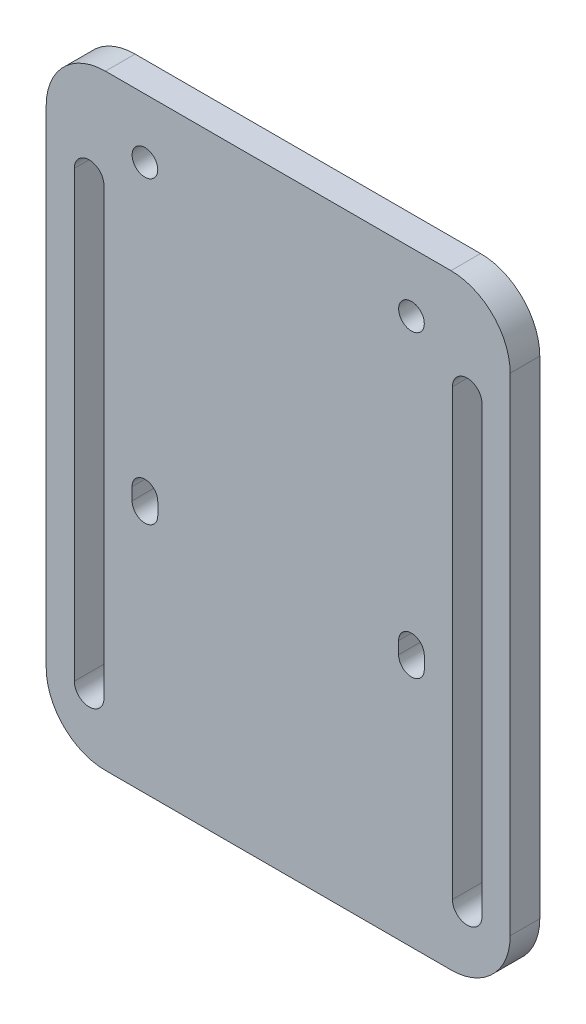
ISO-10303-21;
HEADER;
FILE_DESCRIPTION(('STEP AP214'),'2;1');
FILE_NAME('part.step','',(''),(''),'','','');
FILE_SCHEMA(('AUTOMOTIVE_DESIGN { 1 0 10303 214 1 1 1 1 }'));
ENDSEC;
DATA;
#1=APPLICATION_CONTEXT('core data for automotive mechanical design processes');
#2=APPLICATION_PROTOCOL_DEFINITION('international standard','automotive_design',2000,#1);
#3=PRODUCT_CONTEXT('',#1,'mechanical');
#4=PRODUCT('Part','Part','',(#3));
#5=PRODUCT_RELATED_PRODUCT_CATEGORY('part','',(#4));
#6=PRODUCT_DEFINITION_FORMATION('','',#4);
#7=PRODUCT_DEFINITION_CONTEXT('part definition',#1,'design');
#8=PRODUCT_DEFINITION('design','',#6,#7);
#9=PRODUCT_DEFINITION_SHAPE('','',#8);
#10=(LENGTH_UNIT() NAMED_UNIT(*) SI_UNIT(.MILLI.,.METRE.));
#11=(NAMED_UNIT(*) PLANE_ANGLE_UNIT() SI_UNIT($,.RADIAN.));
#12=(NAMED_UNIT(*) SI_UNIT($,.STERADIAN.) SOLID_ANGLE_UNIT());
#13=UNCERTAINTY_MEASURE_WITH_UNIT(LENGTH_MEASURE(1.E-05),#10,'distance_accuracy_value','');
#14=(GEOMETRIC_REPRESENTATION_CONTEXT(3) GLOBAL_UNCERTAINTY_ASSIGNED_CONTEXT((#13)) GLOBAL_UNIT_ASSIGNED_CONTEXT((#10,
#11,#12)) REPRESENTATION_CONTEXT('',''));
#15=CARTESIAN_POINT('',(0.,0.,0.));
#16=DIRECTION('',(0.,0.,1.));
#17=DIRECTION('',(1.,0.,0.));
#18=AXIS2_PLACEMENT_3D('',#15,#16,#17);
#19=CARTESIAN_POINT('',(-35.3,0.,6.));
#20=DIRECTION('',(1.,0.,0.));
#21=DIRECTION('',(0.,0.,-1.));
#22=AXIS2_PLACEMENT_3D('',#19,#20,#21);
#23=PLANE('',#22);
#24=DIRECTION('',(0.,-1.,0.));
#25=VECTOR('',#24,1.);
#26=CARTESIAN_POINT('',(-35.3,0.,0.));
#27=LINE('',#26,#25);
#28=CARTESIAN_POINT('',(-35.3,102.5,0.));
#29=VERTEX_POINT('',#28);
#30=CARTESIAN_POINT('',(-35.3,12.5,0.));
#31=VERTEX_POINT('',#30);
#32=EDGE_CURVE('E289',#29,#31,#27,.T.);
#33=ORIENTED_EDGE('',*,*,#32,.T.);
#34=DIRECTION('',(0.,0.,-1.));
#35=VECTOR('',#34,1.);
#36=CARTESIAN_POINT('',(-35.3,12.5,6.));
#37=LINE('',#36,#35);
#38=CARTESIAN_POINT('',(-35.3,12.5,6.));
#39=VERTEX_POINT('',#38);
#40=EDGE_CURVE('E11',#39,#31,#37,.T.);
#41=ORIENTED_EDGE('',*,*,#40,.F.);
#42=DIRECTION('',(0.,-1.,0.));
#43=VECTOR('',#42,1.);
#44=CARTESIAN_POINT('',(-35.3,0.,6.));
#45=LINE('',#44,#43);
#46=CARTESIAN_POINT('',(-35.3,102.5,6.));
#47=VERTEX_POINT('',#46);
#48=EDGE_CURVE('E209',#47,#39,#45,.T.);
#49=ORIENTED_EDGE('',*,*,#48,.F.);
#50=DIRECTION('',(0.,0.,-1.));
#51=VECTOR('',#50,1.);
#52=CARTESIAN_POINT('',(-35.3,102.5,6.));
#53=LINE('',#52,#51);
#54=EDGE_CURVE('E53',#47,#29,#53,.T.);
#55=ORIENTED_EDGE('',*,*,#54,.T.);
#56=EDGE_LOOP('',(#33,#41,#49,#55));
#57=FACE_BOUND('',#56,.T.);
#58=ADVANCED_FACE('F34',(#57),#23,.F.);
#59=CARTESIAN_POINT('',(-38.3,12.5,6.));
#60=DIRECTION('',(0.,0.,-1.));
#61=DIRECTION('',(-1.,0.,0.));
#62=AXIS2_PLACEMENT_3D('',#59,#60,#61);
#63=CYLINDRICAL_SURFACE('',#62,3.00000000000002);
#64=CARTESIAN_POINT('',(-38.3,12.5,0.));
#65=DIRECTION('',(0.,0.,1.));
#66=DIRECTION('',(1.,0.,0.));
#67=AXIS2_PLACEMENT_3D('',#64,#65,#66);
#68=CIRCLE('',#67,3.00000000000002);
#69=CARTESIAN_POINT('',(-41.3,12.5,0.));
#70=VERTEX_POINT('',#69);
#71=EDGE_CURVE('E215',#31,#70,#68,.F.);
#72=ORIENTED_EDGE('',*,*,#71,.T.);
#73=DIRECTION('',(0.,0.,-1.));
#74=VECTOR('',#73,1.);
#75=CARTESIAN_POINT('',(-41.3,12.5,6.));
#76=LINE('',#75,#74);
#77=CARTESIAN_POINT('',(-41.3,12.5,6.));
#78=VERTEX_POINT('',#77);
#79=EDGE_CURVE('E44',#78,#70,#76,.T.);
#80=ORIENTED_EDGE('',*,*,#79,.F.);
#81=CARTESIAN_POINT('',(-38.3,12.5,6.));
#82=DIRECTION('',(0.,0.,1.));
#83=DIRECTION('',(1.,0.,0.));
#84=AXIS2_PLACEMENT_3D('',#81,#82,#83);
#85=CIRCLE('',#84,3.00000000000002);
#86=EDGE_CURVE('E203',#39,#78,#85,.F.);
#87=ORIENTED_EDGE('',*,*,#86,.F.);
#88=ORIENTED_EDGE('',*,*,#40,.T.);
#89=EDGE_LOOP('',(#72,#80,#87,#88));
#90=FACE_BOUND('',#89,.T.);
#91=ADVANCED_FACE('F214',(#90),#63,.F.);
#92=CARTESIAN_POINT('',(-41.3,0.,6.));
#93=DIRECTION('',(-1.,0.,0.));
#94=DIRECTION('',(0.,-1.,0.));
#95=AXIS2_PLACEMENT_3D('',#92,#93,#94);
#96=PLANE('',#95);
#97=DIRECTION('',(0.,1.,0.));
#98=VECTOR('',#97,1.);
#99=CARTESIAN_POINT('',(-41.3,0.,0.));
#100=LINE('',#99,#98);
#101=CARTESIAN_POINT('',(-41.3,102.5,0.));
#102=VERTEX_POINT('',#101);
#103=EDGE_CURVE('E292',#70,#102,#100,.T.);
#104=ORIENTED_EDGE('',*,*,#103,.T.);
#105=DIRECTION('',(0.,0.,-1.));
#106=VECTOR('',#105,1.);
#107=CARTESIAN_POINT('',(-41.3,102.5,6.));
#108=LINE('',#107,#106);
#109=CARTESIAN_POINT('',(-41.3,102.5,6.));
#110=VERTEX_POINT('',#109);
#111=EDGE_CURVE('E128',#110,#102,#108,.T.);
#112=ORIENTED_EDGE('',*,*,#111,.F.);
#113=DIRECTION('',(0.,1.,0.));
#114=VECTOR('',#113,1.);
#115=CARTESIAN_POINT('',(-41.3,0.,6.));
#116=LINE('',#115,#114);
#117=EDGE_CURVE('E208',#78,#110,#116,.T.);
#118=ORIENTED_EDGE('',*,*,#117,.F.);
#119=ORIENTED_EDGE('',*,*,#79,.T.);
#120=EDGE_LOOP('',(#104,#112,#118,#119));
#121=FACE_BOUND('',#120,.T.);
#122=ADVANCED_FACE('F219',(#121),#96,.F.);
#123=CARTESIAN_POINT('',(27.,50.,6.));
#124=DIRECTION('',(0.,0.,-1.));
#125=DIRECTION('',(-1.,0.,0.));
#126=AXIS2_PLACEMENT_3D('',#123,#124,#125);
#127=CYLINDRICAL_SURFACE('',#126,2.6000000000001);
#128=CARTESIAN_POINT('',(27.,50.,0.));
#129=DIRECTION('',(0.,0.,1.));
#130=DIRECTION('',(1.,0.,0.));
#131=AXIS2_PLACEMENT_3D('',#128,#129,#130);
#132=CIRCLE('',#131,2.6000000000001);
#133=CARTESIAN_POINT('',(24.3999999999999,50.,0.));
#134=VERTEX_POINT('',#133);
#135=CARTESIAN_POINT('',(29.6000000000001,50.,0.));
#136=VERTEX_POINT('',#135);
#137=EDGE_CURVE('E274',#134,#136,#132,.T.);
#138=ORIENTED_EDGE('',*,*,#137,.F.);
#139=DIRECTION('',(0.,0.,-1.));
#140=VECTOR('',#139,1.);
#141=CARTESIAN_POINT('',(24.3999999999999,50.,6.));
#142=LINE('',#141,#140);
#143=CARTESIAN_POINT('',(24.3999999999999,50.,6.));
#144=VERTEX_POINT('',#143);
#145=EDGE_CURVE('E299',#144,#134,#142,.T.);
#146=ORIENTED_EDGE('',*,*,#145,.F.);
#147=CARTESIAN_POINT('',(27.,50.,6.));
#148=DIRECTION('',(0.,0.,1.));
#149=DIRECTION('',(1.,0.,0.));
#150=AXIS2_PLACEMENT_3D('',#147,#148,#149);
#151=CIRCLE('',#150,2.6000000000001);
#152=CARTESIAN_POINT('',(29.6000000000001,50.,6.));
#153=VERTEX_POINT('',#152);
#154=EDGE_CURVE('E402',#144,#153,#151,.T.);
#155=ORIENTED_EDGE('',*,*,#154,.T.);
#156=DIRECTION('',(0.,0.,-1.));
#157=VECTOR('',#156,1.);
#158=CARTESIAN_POINT('',(29.6000000000001,50.,6.));
#159=LINE('',#158,#157);
#160=EDGE_CURVE('E301',#153,#136,#159,.T.);
#161=ORIENTED_EDGE('',*,*,#160,.T.);
#162=EDGE_LOOP('',(#138,#146,#155,#161));
#163=FACE_BOUND('',#162,.T.);
#164=ADVANCED_FACE('F458',(#163),#127,.F.);
#165=CARTESIAN_POINT('',(24.3999999999999,0.,6.));
#166=DIRECTION('',(-1.,0.,0.));
#167=DIRECTION('',(0.,0.,1.));
#168=AXIS2_PLACEMENT_3D('',#165,#166,#167);
#169=PLANE('',#168);
#170=DIRECTION('',(0.,1.,0.));
#171=VECTOR('',#170,1.);
#172=CARTESIAN_POINT('',(24.3999999999999,0.,0.));
#173=LINE('',#172,#171);
#174=CARTESIAN_POINT('',(24.3999999999999,52.5000000000005,0.));
#175=VERTEX_POINT('',#174);
#176=EDGE_CURVE('E277',#134,#175,#173,.T.);
#177=ORIENTED_EDGE('',*,*,#176,.T.);
#178=DIRECTION('',(0.,0.,-1.));
#179=VECTOR('',#178,1.);
#180=CARTESIAN_POINT('',(24.3999999999999,52.5000000000005,6.));
#181=LINE('',#180,#179);
#182=CARTESIAN_POINT('',(24.3999999999999,52.5000000000005,6.));
#183=VERTEX_POINT('',#182);
#184=EDGE_CURVE('E307',#183,#175,#181,.T.);
#185=ORIENTED_EDGE('',*,*,#184,.F.);
#186=DIRECTION('',(0.,1.,0.));
#187=VECTOR('',#186,1.);
#188=CARTESIAN_POINT('',(24.3999999999999,0.,6.));
#189=LINE('',#188,#187);
#190=EDGE_CURVE('E405',#144,#183,#189,.T.);
#191=ORIENTED_EDGE('',*,*,#190,.F.);
#192=ORIENTED_EDGE('',*,*,#145,.T.);
#193=EDGE_LOOP('',(#177,#185,#191,#192));
#194=FACE_BOUND('',#193,.T.);
#195=ADVANCED_FACE('F454',(#194),#169,.F.);
#196=CARTESIAN_POINT('',(27.,52.5000000000005,6.));
#197=DIRECTION('',(0.,0.,-1.));
#198=DIRECTION('',(-1.,0.,0.));
#199=AXIS2_PLACEMENT_3D('',#196,#197,#198);
#200=CYLINDRICAL_SURFACE('',#199,2.6000000000001);
#201=CARTESIAN_POINT('',(27.,52.5000000000005,0.));
#202=DIRECTION('',(0.,0.,1.));
#203=DIRECTION('',(1.,0.,0.));
#204=AXIS2_PLACEMENT_3D('',#201,#202,#203);
#205=CIRCLE('',#204,2.6000000000001);
#206=CARTESIAN_POINT('',(29.6000000000001,52.5000000000005,0.));
#207=VERTEX_POINT('',#206);
#208=EDGE_CURVE('E280',#175,#207,#205,.F.);
#209=ORIENTED_EDGE('',*,*,#208,.T.);
#210=DIRECTION('',(0.,0.,-1.));
#211=VECTOR('',#210,1.);
#212=CARTESIAN_POINT('',(29.6000000000001,52.5000000000005,6.));
#213=LINE('',#212,#211);
#214=CARTESIAN_POINT('',(29.6000000000001,52.5000000000005,6.));
#215=VERTEX_POINT('',#214);
#216=EDGE_CURVE('E303',#215,#207,#213,.T.);
#217=ORIENTED_EDGE('',*,*,#216,.F.);
#218=CARTESIAN_POINT('',(27.,52.5000000000005,6.));
#219=DIRECTION('',(0.,0.,1.));
#220=DIRECTION('',(1.,0.,0.));
#221=AXIS2_PLACEMENT_3D('',#218,#219,#220);
#222=CIRCLE('',#221,2.6000000000001);
#223=EDGE_CURVE('E408',#183,#215,#222,.F.);
#224=ORIENTED_EDGE('',*,*,#223,.F.);
#225=ORIENTED_EDGE('',*,*,#184,.T.);
#226=EDGE_LOOP('',(#209,#217,#224,#225));
#227=FACE_BOUND('',#226,.T.);
#228=ADVANCED_FACE('F450',(#227),#200,.F.);
#229=CARTESIAN_POINT('',(-35.,110.7,6.));
#230=DIRECTION('',(0.,0.,-1.));
#231=DIRECTION('',(-1.,0.,0.));
#232=AXIS2_PLACEMENT_3D('',#229,#230,#231);
#233=CYLINDRICAL_SURFACE('',#232,12.);
#234=CARTESIAN_POINT('',(-35.,110.7,0.));
#235=DIRECTION('',(0.,0.,1.));
#236=DIRECTION('',(1.,0.,0.));
#237=AXIS2_PLACEMENT_3D('',#234,#235,#236);
#238=CIRCLE('',#237,12.);
#239=CARTESIAN_POINT('',(-47.,110.7,0.));
#240=VERTEX_POINT('',#239);
#241=CARTESIAN_POINT('',(-35.,122.7,0.));
#242=VERTEX_POINT('',#241);
#243=EDGE_CURVE('E247',#240,#242,#238,.F.);
#244=ORIENTED_EDGE('',*,*,#243,.F.);
#245=DIRECTION('',(0.,0.,-1.));
#246=VECTOR('',#245,1.);
#247=CARTESIAN_POINT('',(-47.,110.7,6.));
#248=LINE('',#247,#246);
#249=CARTESIAN_POINT('',(-47.,110.7,6.));
#250=VERTEX_POINT('',#249);
#251=EDGE_CURVE('E304',#250,#240,#248,.T.);
#252=ORIENTED_EDGE('',*,*,#251,.F.);
#253=CARTESIAN_POINT('',(-35.,110.7,6.));
#254=DIRECTION('',(0.,0.,1.));
#255=DIRECTION('',(1.,0.,0.));
#256=AXIS2_PLACEMENT_3D('',#253,#254,#255);
#257=CIRCLE('',#256,12.);
#258=CARTESIAN_POINT('',(-35.,122.7,6.));
#259=VERTEX_POINT('',#258);
#260=EDGE_CURVE('E378',#250,#259,#257,.F.);
#261=ORIENTED_EDGE('',*,*,#260,.T.);
#262=DIRECTION('',(0.,0.,-1.));
#263=VECTOR('',#262,1.);
#264=CARTESIAN_POINT('',(-35.,122.7,6.));
#265=LINE('',#264,#263);
#266=EDGE_CURVE('E311',#259,#242,#265,.T.);
#267=ORIENTED_EDGE('',*,*,#266,.T.);
#268=EDGE_LOOP('',(#244,#252,#261,#267));
#269=FACE_BOUND('',#268,.T.);
#270=ADVANCED_FACE('F453',(#269),#233,.T.);
#271=CARTESIAN_POINT('',(-47.,0.,6.));
#272=DIRECTION('',(-1.,0.,0.));
#273=DIRECTION('',(0.,-1.,0.));
#274=AXIS2_PLACEMENT_3D('',#271,#272,#273);
#275=PLANE('',#274);
#276=DIRECTION('',(0.,1.,0.));
#277=VECTOR('',#276,1.);
#278=CARTESIAN_POINT('',(-47.,0.,0.));
#279=LINE('',#278,#277);
#280=CARTESIAN_POINT('',(-47.,12.,0.));
#281=VERTEX_POINT('',#280);
#282=EDGE_CURVE('E250',#281,#240,#279,.T.);
#283=ORIENTED_EDGE('',*,*,#282,.F.);
#284=DIRECTION('',(0.,0.,-1.));
#285=VECTOR('',#284,1.);
#286=CARTESIAN_POINT('',(-47.,12.,6.));
#287=LINE('',#286,#285);
#288=CARTESIAN_POINT('',(-47.,12.,6.));
#289=VERTEX_POINT('',#288);
#290=EDGE_CURVE('E324',#289,#281,#287,.T.);
#291=ORIENTED_EDGE('',*,*,#290,.F.);
#292=DIRECTION('',(0.,1.,0.));
#293=VECTOR('',#292,1.);
#294=CARTESIAN_POINT('',(-47.,0.,6.));
#295=LINE('',#294,#293);
#296=EDGE_CURVE('E381',#289,#250,#295,.T.);
#297=ORIENTED_EDGE('',*,*,#296,.T.);
#298=ORIENTED_EDGE('',*,*,#251,.T.);
#299=EDGE_LOOP('',(#283,#291,#297,#298));
#300=FACE_BOUND('',#299,.T.);
#301=ADVANCED_FACE('F490',(#300),#275,.T.);
#302=CARTESIAN_POINT('',(-35.,12.,6.));
#303=DIRECTION('',(0.,0.,-1.));
#304=DIRECTION('',(-1.,0.,0.));
#305=AXIS2_PLACEMENT_3D('',#302,#303,#304);
#306=CYLINDRICAL_SURFACE('',#305,12.);
#307=CARTESIAN_POINT('',(-35.,12.,0.));
#308=DIRECTION('',(0.,0.,1.));
#309=DIRECTION('',(1.,0.,0.));
#310=AXIS2_PLACEMENT_3D('',#307,#308,#309);
#311=CIRCLE('',#310,12.);
#312=CARTESIAN_POINT('',(-35.,0.,0.));
#313=VERTEX_POINT('',#312);
#314=EDGE_CURVE('E253',#281,#313,#311,.T.);
#315=ORIENTED_EDGE('',*,*,#314,.T.);
#316=DIRECTION('',(0.,0.,-1.));
#317=VECTOR('',#316,1.);
#318=CARTESIAN_POINT('',(-35.,0.,6.));
#319=LINE('',#318,#317);
#320=CARTESIAN_POINT('',(-35.,0.,6.));
#321=VERTEX_POINT('',#320);
#322=EDGE_CURVE('E322',#321,#313,#319,.T.);
#323=ORIENTED_EDGE('',*,*,#322,.F.);
#324=CARTESIAN_POINT('',(-35.,12.,6.));
#325=DIRECTION('',(0.,0.,1.));
#326=DIRECTION('',(1.,0.,0.));
#327=AXIS2_PLACEMENT_3D('',#324,#325,#326);
#328=CIRCLE('',#327,12.);
#329=EDGE_CURVE('E384',#289,#321,#328,.T.);
#330=ORIENTED_EDGE('',*,*,#329,.F.);
#331=ORIENTED_EDGE('',*,*,#290,.T.);
#332=EDGE_LOOP('',(#315,#323,#330,#331));
#333=FACE_BOUND('',#332,.T.);
#334=ADVANCED_FACE('F486',(#333),#306,.T.);
#335=CARTESIAN_POINT('',(0.,0.,6.));
#336=DIRECTION('',(0.,-1.,0.));
#337=DIRECTION('',(1.,0.,0.));
#338=AXIS2_PLACEMENT_3D('',#335,#336,#337);
#339=PLANE('',#338);
#340=DIRECTION('',(-1.,0.,0.));
#341=VECTOR('',#340,1.);
#342=CARTESIAN_POINT('',(0.,0.,0.));
#343=LINE('',#342,#341);
#344=CARTESIAN_POINT('',(35.,0.,0.));
#345=VERTEX_POINT('',#344);
#346=EDGE_CURVE('E256',#345,#313,#343,.T.);
#347=ORIENTED_EDGE('',*,*,#346,.F.);
#348=DIRECTION('',(0.,0.,-1.));
#349=VECTOR('',#348,1.);
#350=CARTESIAN_POINT('',(35.,0.,6.));
#351=LINE('',#350,#349);
#352=CARTESIAN_POINT('',(35.,0.,6.));
#353=VERTEX_POINT('',#352);
#354=EDGE_CURVE('E320',#353,#345,#351,.T.);
#355=ORIENTED_EDGE('',*,*,#354,.F.);
#356=DIRECTION('',(-1.,0.,0.));
#357=VECTOR('',#356,1.);
#358=CARTESIAN_POINT('',(0.,0.,6.));
#359=LINE('',#358,#357);
#360=EDGE_CURVE('E386',#353,#321,#359,.T.);
#361=ORIENTED_EDGE('',*,*,#360,.T.);
#362=ORIENTED_EDGE('',*,*,#322,.T.);
#363=EDGE_LOOP('',(#347,#355,#361,#362));
#364=FACE_BOUND('',#363,.T.);
#365=ADVANCED_FACE('F482',(#364),#339,.T.);
#366=CARTESIAN_POINT('',(35.,12.,6.));
#367=DIRECTION('',(0.,0.,-1.));
#368=DIRECTION('',(-1.,0.,0.));
#369=AXIS2_PLACEMENT_3D('',#366,#367,#368);
#370=CYLINDRICAL_SURFACE('',#369,12.);
#371=CARTESIAN_POINT('',(35.,12.,0.));
#372=DIRECTION('',(0.,0.,1.));
#373=DIRECTION('',(1.,0.,0.));
#374=AXIS2_PLACEMENT_3D('',#371,#372,#373);
#375=CIRCLE('',#374,12.);
#376=CARTESIAN_POINT('',(47.,12.,0.));
#377=VERTEX_POINT('',#376);
#378=EDGE_CURVE('E259',#345,#377,#375,.T.);
#379=ORIENTED_EDGE('',*,*,#378,.T.);
#380=DIRECTION('',(0.,0.,-1.));
#381=VECTOR('',#380,1.);
#382=CARTESIAN_POINT('',(47.,12.,6.));
#383=LINE('',#382,#381);
#384=CARTESIAN_POINT('',(47.,12.,6.));
#385=VERTEX_POINT('',#384);
#386=EDGE_CURVE('E318',#385,#377,#383,.T.);
#387=ORIENTED_EDGE('',*,*,#386,.F.);
#388=CARTESIAN_POINT('',(35.,12.,6.));
#389=DIRECTION('',(0.,0.,1.));
#390=DIRECTION('',(1.,0.,0.));
#391=AXIS2_PLACEMENT_3D('',#388,#389,#390);
#392=CIRCLE('',#391,12.);
#393=EDGE_CURVE('E389',#353,#385,#392,.T.);
#394=ORIENTED_EDGE('',*,*,#393,.F.);
#395=ORIENTED_EDGE('',*,*,#354,.T.);
#396=EDGE_LOOP('',(#379,#387,#394,#395));
#397=FACE_BOUND('',#396,.T.);
#398=ADVANCED_FACE('F478',(#397),#370,.T.);
#399=CARTESIAN_POINT('',(47.,0.,6.));
#400=DIRECTION('',(1.,0.,0.));
#401=DIRECTION('',(0.,1.,0.));
#402=AXIS2_PLACEMENT_3D('',#399,#400,#401);
#403=PLANE('',#402);
#404=DIRECTION('',(0.,-1.,0.));
#405=VECTOR('',#404,1.);
#406=CARTESIAN_POINT('',(47.,0.,0.));
#407=LINE('',#406,#405);
#408=CARTESIAN_POINT('',(47.,110.7,0.));
#409=VERTEX_POINT('',#408);
#410=EDGE_CURVE('E262',#409,#377,#407,.T.);
#411=ORIENTED_EDGE('',*,*,#410,.F.);
#412=DIRECTION('',(0.,0.,-1.));
#413=VECTOR('',#412,1.);
#414=CARTESIAN_POINT('',(47.,110.7,6.));
#415=LINE('',#414,#413);
#416=CARTESIAN_POINT('',(47.,110.7,6.));
#417=VERTEX_POINT('',#416);
#418=EDGE_CURVE('E316',#417,#409,#415,.T.);
#419=ORIENTED_EDGE('',*,*,#418,.F.);
#420=DIRECTION('',(0.,-1.,0.));
#421=VECTOR('',#420,1.);
#422=CARTESIAN_POINT('',(47.,0.,6.));
#423=LINE('',#422,#421);
#424=EDGE_CURVE('E391',#417,#385,#423,.T.);
#425=ORIENTED_EDGE('',*,*,#424,.T.);
#426=ORIENTED_EDGE('',*,*,#386,.T.);
#427=EDGE_LOOP('',(#411,#419,#425,#426));
#428=FACE_BOUND('',#427,.T.);
#429=ADVANCED_FACE('F474',(#428),#403,.T.);
#430=CARTESIAN_POINT('',(35.,110.7,6.));
#431=DIRECTION('',(0.,0.,-1.));
#432=DIRECTION('',(-1.,0.,0.));
#433=AXIS2_PLACEMENT_3D('',#430,#431,#432);
#434=CYLINDRICAL_SURFACE('',#433,12.);
#435=CARTESIAN_POINT('',(35.,110.7,0.));
#436=DIRECTION('',(0.,0.,1.));
#437=DIRECTION('',(1.,0.,0.));
#438=AXIS2_PLACEMENT_3D('',#435,#436,#437);
#439=CIRCLE('',#438,12.);
#440=CARTESIAN_POINT('',(35.,122.7,0.));
#441=VERTEX_POINT('',#440);
#442=EDGE_CURVE('E265',#409,#441,#439,.T.);
#443=ORIENTED_EDGE('',*,*,#442,.T.);
#444=DIRECTION('',(0.,0.,-1.));
#445=VECTOR('',#444,1.);
#446=CARTESIAN_POINT('',(35.,122.7,6.));
#447=LINE('',#446,#445);
#448=CARTESIAN_POINT('',(35.,122.7,6.));
#449=VERTEX_POINT('',#448);
#450=EDGE_CURVE('E313',#449,#441,#447,.T.);
#451=ORIENTED_EDGE('',*,*,#450,.F.);
#452=CARTESIAN_POINT('',(35.,110.7,6.));
#453=DIRECTION('',(0.,0.,1.));
#454=DIRECTION('',(1.,0.,0.));
#455=AXIS2_PLACEMENT_3D('',#452,#453,#454);
#456=CIRCLE('',#455,12.);
#457=EDGE_CURVE('E394',#417,#449,#456,.T.);
#458=ORIENTED_EDGE('',*,*,#457,.F.);
#459=ORIENTED_EDGE('',*,*,#418,.T.);
#460=EDGE_LOOP('',(#443,#451,#458,#459));
#461=FACE_BOUND('',#460,.T.);
#462=ADVANCED_FACE('F470',(#461),#434,.T.);
#463=CARTESIAN_POINT('',(35.3,0.,6.));
#464=DIRECTION('',(-1.,0.,0.));
#465=DIRECTION('',(0.,-1.,0.));
#466=AXIS2_PLACEMENT_3D('',#463,#464,#465);
#467=PLANE('',#466);
#468=DIRECTION('',(0.,1.,0.));
#469=VECTOR('',#468,1.);
#470=CARTESIAN_POINT('',(35.3,0.,0.));
#471=LINE('',#470,#469);
#472=CARTESIAN_POINT('',(35.3,12.5,0.));
#473=VERTEX_POINT('',#472);
#474=CARTESIAN_POINT('',(35.3,102.5,0.));
#475=VERTEX_POINT('',#474);
#476=EDGE_CURVE('E236',#473,#475,#471,.T.);
#477=ORIENTED_EDGE('',*,*,#476,.T.);
#478=DIRECTION('',(0.,0.,-1.));
#479=VECTOR('',#478,1.);
#480=CARTESIAN_POINT('',(35.3,102.5,6.));
#481=LINE('',#480,#479);
#482=CARTESIAN_POINT('',(35.3,102.5,6.));
#483=VERTEX_POINT('',#482);
#484=EDGE_CURVE('E314',#483,#475,#481,.T.);
#485=ORIENTED_EDGE('',*,*,#484,.F.);
#486=DIRECTION('',(0.,1.,0.));
#487=VECTOR('',#486,1.);
#488=CARTESIAN_POINT('',(35.3,0.,6.));
#489=LINE('',#488,#487);
#490=CARTESIAN_POINT('',(35.3,12.5,6.));
#491=VERTEX_POINT('',#490);
#492=EDGE_CURVE('E364',#491,#483,#489,.T.);
#493=ORIENTED_EDGE('',*,*,#492,.F.);
#494=DIRECTION('',(0.,0.,-1.));
#495=VECTOR('',#494,1.);
#496=CARTESIAN_POINT('',(35.3,12.5,6.));
#497=LINE('',#496,#495);
#498=EDGE_CURVE('E327',#491,#473,#497,.T.);
#499=ORIENTED_EDGE('',*,*,#498,.T.);
#500=EDGE_LOOP('',(#477,#485,#493,#499));
#501=FACE_BOUND('',#500,.T.);
#502=ADVANCED_FACE('F473',(#501),#467,.F.);
#503=CARTESIAN_POINT('',(38.3,102.5,6.));
#504=DIRECTION('',(0.,0.,-1.));
#505=DIRECTION('',(-1.,0.,0.));
#506=AXIS2_PLACEMENT_3D('',#503,#504,#505);
#507=CYLINDRICAL_SURFACE('',#506,3.00000000000003);
#508=CARTESIAN_POINT('',(38.3,102.5,0.));
#509=DIRECTION('',(0.,0.,1.));
#510=DIRECTION('',(1.,0.,0.));
#511=AXIS2_PLACEMENT_3D('',#508,#509,#510);
#512=CIRCLE('',#511,3.00000000000003);
#513=CARTESIAN_POINT('',(41.3,102.5,0.));
#514=VERTEX_POINT('',#513);
#515=EDGE_CURVE('E239',#475,#514,#512,.F.);
#516=ORIENTED_EDGE('',*,*,#515,.T.);
#517=DIRECTION('',(0.,0.,-1.));
#518=VECTOR('',#517,1.);
#519=CARTESIAN_POINT('',(41.3,102.5,6.));
#520=LINE('',#519,#518);
#521=CARTESIAN_POINT('',(41.3,102.5,6.));
#522=VERTEX_POINT('',#521);
#523=EDGE_CURVE('E331',#522,#514,#520,.T.);
#524=ORIENTED_EDGE('',*,*,#523,.F.);
#525=CARTESIAN_POINT('',(38.3,102.5,6.));
#526=DIRECTION('',(0.,0.,1.));
#527=DIRECTION('',(1.,0.,0.));
#528=AXIS2_PLACEMENT_3D('',#525,#526,#527);
#529=CIRCLE('',#528,3.00000000000003);
#530=EDGE_CURVE('E371',#483,#522,#529,.F.);
#531=ORIENTED_EDGE('',*,*,#530,.F.);
#532=ORIENTED_EDGE('',*,*,#484,.T.);
#533=EDGE_LOOP('',(#516,#524,#531,#532));
#534=FACE_BOUND('',#533,.T.);
#535=ADVANCED_FACE('F504',(#534),#507,.F.);
#536=CARTESIAN_POINT('',(41.3,0.,6.));
#537=DIRECTION('',(1.,0.,0.));
#538=DIRECTION('',(0.,1.,0.));
#539=AXIS2_PLACEMENT_3D('',#536,#537,#538);
#540=PLANE('',#539);
#541=DIRECTION('',(0.,-1.,0.));
#542=VECTOR('',#541,1.);
#543=CARTESIAN_POINT('',(41.3,0.,0.));
#544=LINE('',#543,#542);
#545=CARTESIAN_POINT('',(41.3,12.5,0.));
#546=VERTEX_POINT('',#545);
#547=EDGE_CURVE('E241',#514,#546,#544,.T.);
#548=ORIENTED_EDGE('',*,*,#547,.T.);
#549=DIRECTION('',(0.,0.,-1.));
#550=VECTOR('',#549,1.);
#551=CARTESIAN_POINT('',(41.3,12.5,6.));
#552=LINE('',#551,#550);
#553=CARTESIAN_POINT('',(41.3,12.5,6.));
#554=VERTEX_POINT('',#553);
#555=EDGE_CURVE('E329',#554,#546,#552,.T.);
#556=ORIENTED_EDGE('',*,*,#555,.F.);
#557=DIRECTION('',(0.,-1.,0.));
#558=VECTOR('',#557,1.);
#559=CARTESIAN_POINT('',(41.3,0.,6.));
#560=LINE('',#559,#558);
#561=EDGE_CURVE('E373',#522,#554,#560,.T.);
#562=ORIENTED_EDGE('',*,*,#561,.F.);
#563=ORIENTED_EDGE('',*,*,#523,.T.);
#564=EDGE_LOOP('',(#548,#556,#562,#563));
#565=FACE_BOUND('',#564,.T.);
#566=ADVANCED_FACE('F501',(#565),#540,.F.);
#567=CARTESIAN_POINT('',(-27.0000000000001,52.5000000000005,6.));
#568=DIRECTION('',(0.,0.,-1.));
#569=DIRECTION('',(-1.,0.,0.));
#570=AXIS2_PLACEMENT_3D('',#567,#568,#569);
#571=CYLINDRICAL_SURFACE('',#570,2.6000000000001);
#572=CARTESIAN_POINT('',(-27.0000000000001,52.5000000000005,0.));
#573=DIRECTION('',(0.,0.,1.));
#574=DIRECTION('',(1.,0.,0.));
#575=AXIS2_PLACEMENT_3D('',#572,#573,#574);
#576=CIRCLE('',#575,2.6000000000001);
#577=CARTESIAN_POINT('',(-24.4,52.5000000000005,0.));
#578=VERTEX_POINT('',#577);
#579=CARTESIAN_POINT('',(-29.6000000000002,52.5000000000005,0.));
#580=VERTEX_POINT('',#579);
#581=EDGE_CURVE('E226',#578,#580,#576,.T.);
#582=ORIENTED_EDGE('',*,*,#581,.F.);
#583=DIRECTION('',(0.,0.,-1.));
#584=VECTOR('',#583,1.);
#585=CARTESIAN_POINT('',(-24.4,52.5000000000005,6.));
#586=LINE('',#585,#584);
#587=CARTESIAN_POINT('',(-24.4,52.5000000000005,6.));
#588=VERTEX_POINT('',#587);
#589=EDGE_CURVE('E38',#588,#578,#586,.T.);
#590=ORIENTED_EDGE('',*,*,#589,.F.);
#591=CARTESIAN_POINT('',(-27.0000000000001,52.5000000000005,6.));
#592=DIRECTION('',(0.,0.,1.));
#593=DIRECTION('',(1.,0.,0.));
#594=AXIS2_PLACEMENT_3D('',#591,#592,#593);
#595=CIRCLE('',#594,2.6000000000001);
#596=CARTESIAN_POINT('',(-29.6000000000002,52.5000000000005,6.));
#597=VERTEX_POINT('',#596);
#598=EDGE_CURVE('E297',#588,#597,#595,.T.);
#599=ORIENTED_EDGE('',*,*,#598,.T.);
#600=DIRECTION('',(0.,0.,-1.));
#601=VECTOR('',#600,1.);
#602=CARTESIAN_POINT('',(-29.6000000000002,52.5000000000005,6.));
#603=LINE('',#602,#601);
#604=EDGE_CURVE('E222',#597,#580,#603,.T.);
#605=ORIENTED_EDGE('',*,*,#604,.T.);
#606=EDGE_LOOP('',(#582,#590,#599,#605));
#607=FACE_BOUND('',#606,.T.);
#608=ADVANCED_FACE('F36',(#607),#571,.F.);
#609=CARTESIAN_POINT('',(-24.4,0.,6.));
#610=DIRECTION('',(1.,0.,0.));
#611=DIRECTION('',(0.,0.,-1.));
#612=AXIS2_PLACEMENT_3D('',#609,#610,#611);
#613=PLANE('',#612);
#614=DIRECTION('',(0.,-1.,0.));
#615=VECTOR('',#614,1.);
#616=CARTESIAN_POINT('',(-24.4,0.,0.));
#617=LINE('',#616,#615);
#618=CARTESIAN_POINT('',(-24.4,50.,0.));
#619=VERTEX_POINT('',#618);
#620=EDGE_CURVE('E229',#578,#619,#617,.T.);
#621=ORIENTED_EDGE('',*,*,#620,.T.);
#622=DIRECTION('',(0.,0.,-1.));
#623=VECTOR('',#622,1.);
#624=CARTESIAN_POINT('',(-24.4,50.,6.));
#625=LINE('',#624,#623);
#626=CARTESIAN_POINT('',(-24.4,50.,6.));
#627=VERTEX_POINT('',#626);
#628=EDGE_CURVE('E339',#627,#619,#625,.T.);
#629=ORIENTED_EDGE('',*,*,#628,.F.);
#630=DIRECTION('',(0.,-1.,0.));
#631=VECTOR('',#630,1.);
#632=CARTESIAN_POINT('',(-24.4,0.,6.));
#633=LINE('',#632,#631);
#634=EDGE_CURVE('E348',#588,#627,#633,.T.);
#635=ORIENTED_EDGE('',*,*,#634,.F.);
#636=ORIENTED_EDGE('',*,*,#589,.T.);
#637=EDGE_LOOP('',(#621,#629,#635,#636));
#638=FACE_BOUND('',#637,.T.);
#639=ADVANCED_FACE('F347',(#638),#613,.F.);
#640=CARTESIAN_POINT('',(-27.0000000000001,50.,6.));
#641=DIRECTION('',(0.,0.,-1.));
#642=DIRECTION('',(-1.,0.,0.));
#643=AXIS2_PLACEMENT_3D('',#640,#641,#642);
#644=CYLINDRICAL_SURFACE('',#643,2.6000000000001);
#645=CARTESIAN_POINT('',(-27.0000000000001,50.,0.));
#646=DIRECTION('',(0.,0.,1.));
#647=DIRECTION('',(1.,0.,0.));
#648=AXIS2_PLACEMENT_3D('',#645,#646,#647);
#649=CIRCLE('',#648,2.6000000000001);
#650=CARTESIAN_POINT('',(-29.6000000000002,50.,0.));
#651=VERTEX_POINT('',#650);
#652=EDGE_CURVE('E231',#619,#651,#649,.F.);
#653=ORIENTED_EDGE('',*,*,#652,.T.);
#654=DIRECTION('',(0.,0.,-1.));
#655=VECTOR('',#654,1.);
#656=CARTESIAN_POINT('',(-29.6000000000002,50.,6.));
#657=LINE('',#656,#655);
#658=CARTESIAN_POINT('',(-29.6000000000002,50.,6.));
#659=VERTEX_POINT('',#658);
#660=EDGE_CURVE('E337',#659,#651,#657,.T.);
#661=ORIENTED_EDGE('',*,*,#660,.F.);
#662=CARTESIAN_POINT('',(-27.0000000000001,50.,6.));
#663=DIRECTION('',(0.,0.,1.));
#664=DIRECTION('',(1.,0.,0.));
#665=AXIS2_PLACEMENT_3D('',#662,#663,#664);
#666=CIRCLE('',#665,2.6000000000001);
#667=EDGE_CURVE('E361',#627,#659,#666,.F.);
#668=ORIENTED_EDGE('',*,*,#667,.F.);
#669=ORIENTED_EDGE('',*,*,#628,.T.);
#670=EDGE_LOOP('',(#653,#661,#668,#669));
#671=FACE_BOUND('',#670,.T.);
#672=ADVANCED_FACE('F360',(#671),#644,.F.);
#673=CARTESIAN_POINT('',(-27.,110.7,6.));
#674=DIRECTION('',(0.,0.,-1.));
#675=DIRECTION('',(-1.,0.,0.));
#676=AXIS2_PLACEMENT_3D('',#673,#674,#675);
#677=CYLINDRICAL_SURFACE('',#676,2.6);
#678=CARTESIAN_POINT('',(-27.,110.7,6.));
#679=DIRECTION('',(0.,0.,1.));
#680=DIRECTION('',(1.,0.,0.));
#681=AXIS2_PLACEMENT_3D('',#678,#679,#680);
#682=CIRCLE('',#681,2.6);
#683=CARTESIAN_POINT('',(-24.4,110.7,6.));
#684=VERTEX_POINT('',#683);
#685=EDGE_CURVE('E413',#684,#684,#682,.F.);
#686=ORIENTED_EDGE('',*,*,#685,.F.);
#687=EDGE_LOOP('',(#686));
#688=FACE_BOUND('',#687,.T.);
#689=CARTESIAN_POINT('',(-27.,110.7,0.));
#690=DIRECTION('',(0.,0.,1.));
#691=DIRECTION('',(1.,0.,0.));
#692=AXIS2_PLACEMENT_3D('',#689,#690,#691);
#693=CIRCLE('',#692,2.6);
#694=CARTESIAN_POINT('',(-24.4,110.7,0.));
#695=VERTEX_POINT('',#694);
#696=EDGE_CURVE('E286',#695,#695,#693,.F.);
#697=ORIENTED_EDGE('',*,*,#696,.T.);
#698=EDGE_LOOP('',(#697));
#699=FACE_BOUND('',#698,.T.);
#700=ADVANCED_FACE('F418',(#688,#699),#677,.F.);
#701=CARTESIAN_POINT('',(29.6000000000002,0.,6.));
#702=DIRECTION('',(1.,0.,0.));
#703=DIRECTION('',(0.,1.,0.));
#704=AXIS2_PLACEMENT_3D('',#701,#702,#703);
#705=PLANE('',#704);
#706=DIRECTION('',(0.,-1.,0.));
#707=VECTOR('',#706,1.);
#708=CARTESIAN_POINT('',(29.6000000000002,0.,0.));
#709=LINE('',#708,#707);
#710=EDGE_CURVE('E283',#207,#136,#709,.T.);
#711=ORIENTED_EDGE('',*,*,#710,.T.);
#712=ORIENTED_EDGE('',*,*,#160,.F.);
#713=DIRECTION('',(0.,-1.,0.));
#714=VECTOR('',#713,1.);
#715=CARTESIAN_POINT('',(29.6000000000002,0.,6.));
#716=LINE('',#715,#714);
#717=EDGE_CURVE('E411',#215,#153,#716,.T.);
#718=ORIENTED_EDGE('',*,*,#717,.F.);
#719=ORIENTED_EDGE('',*,*,#216,.T.);
#720=EDGE_LOOP('',(#711,#712,#718,#719));
#721=FACE_BOUND('',#720,.T.);
#722=ADVANCED_FACE('F421',(#721),#705,.F.);
#723=CARTESIAN_POINT('',(27.,110.7,6.));
#724=DIRECTION('',(0.,0.,-1.));
#725=DIRECTION('',(-1.,0.,0.));
#726=AXIS2_PLACEMENT_3D('',#723,#724,#725);
#727=CYLINDRICAL_SURFACE('',#726,2.6);
#728=CARTESIAN_POINT('',(27.,110.7,6.));
#729=DIRECTION('',(0.,0.,1.));
#730=DIRECTION('',(1.,0.,0.));
#731=AXIS2_PLACEMENT_3D('',#728,#729,#730);
#732=CIRCLE('',#731,2.6);
#733=CARTESIAN_POINT('',(29.6,110.7,6.));
#734=VERTEX_POINT('',#733);
#735=EDGE_CURVE('E399',#734,#734,#732,.T.);
#736=ORIENTED_EDGE('',*,*,#735,.T.);
#737=EDGE_LOOP('',(#736));
#738=FACE_BOUND('',#737,.T.);
#739=CARTESIAN_POINT('',(27.,110.7,0.));
#740=DIRECTION('',(0.,0.,1.));
#741=DIRECTION('',(1.,0.,0.));
#742=AXIS2_PLACEMENT_3D('',#739,#740,#741);
#743=CIRCLE('',#742,2.6);
#744=CARTESIAN_POINT('',(29.6,110.7,0.));
#745=VERTEX_POINT('',#744);
#746=EDGE_CURVE('E271',#745,#745,#743,.T.);
#747=ORIENTED_EDGE('',*,*,#746,.F.);
#748=EDGE_LOOP('',(#747));
#749=FACE_BOUND('',#748,.T.);
#750=ADVANCED_FACE('F448',(#738,#749),#727,.F.);
#751=CARTESIAN_POINT('',(0.,122.7,6.));
#752=DIRECTION('',(0.,1.,0.));
#753=DIRECTION('',(-1.,0.,0.));
#754=AXIS2_PLACEMENT_3D('',#751,#752,#753);
#755=PLANE('',#754);
#756=DIRECTION('',(1.,0.,0.));
#757=VECTOR('',#756,1.);
#758=CARTESIAN_POINT('',(0.,122.7,0.));
#759=LINE('',#758,#757);
#760=EDGE_CURVE('E268',#242,#441,#759,.T.);
#761=ORIENTED_EDGE('',*,*,#760,.F.);
#762=ORIENTED_EDGE('',*,*,#266,.F.);
#763=DIRECTION('',(1.,0.,0.));
#764=VECTOR('',#763,1.);
#765=CARTESIAN_POINT('',(0.,122.7,6.));
#766=LINE('',#765,#764);
#767=EDGE_CURVE('E396',#259,#449,#766,.T.);
#768=ORIENTED_EDGE('',*,*,#767,.T.);
#769=ORIENTED_EDGE('',*,*,#450,.T.);
#770=EDGE_LOOP('',(#761,#762,#768,#769));
#771=FACE_BOUND('',#770,.T.);
#772=ADVANCED_FACE('F465',(#771),#755,.T.);
#773=CARTESIAN_POINT('',(38.3,12.5,6.));
#774=DIRECTION('',(0.,0.,-1.));
#775=DIRECTION('',(-1.,0.,0.));
#776=AXIS2_PLACEMENT_3D('',#773,#774,#775);
#777=CYLINDRICAL_SURFACE('',#776,3.00000000000002);
#778=CARTESIAN_POINT('',(38.3,12.5,0.));
#779=DIRECTION('',(0.,0.,1.));
#780=DIRECTION('',(1.,0.,0.));
#781=AXIS2_PLACEMENT_3D('',#778,#779,#780);
#782=CIRCLE('',#781,3.00000000000002);
#783=EDGE_CURVE('E244',#473,#546,#782,.T.);
#784=ORIENTED_EDGE('',*,*,#783,.F.);
#785=ORIENTED_EDGE('',*,*,#498,.F.);
#786=CARTESIAN_POINT('',(38.3,12.5,6.));
#787=DIRECTION('',(0.,0.,1.));
#788=DIRECTION('',(1.,0.,0.));
#789=AXIS2_PLACEMENT_3D('',#786,#787,#788);
#790=CIRCLE('',#789,3.00000000000002);
#791=EDGE_CURVE('E375',#491,#554,#790,.T.);
#792=ORIENTED_EDGE('',*,*,#791,.T.);
#793=ORIENTED_EDGE('',*,*,#555,.T.);
#794=EDGE_LOOP('',(#784,#785,#792,#793));
#795=FACE_BOUND('',#794,.T.);
#796=ADVANCED_FACE('F436',(#795),#777,.F.);
#797=CARTESIAN_POINT('',(-29.6000000000003,0.,6.));
#798=DIRECTION('',(-1.,0.,0.));
#799=DIRECTION('',(0.,-1.,0.));
#800=AXIS2_PLACEMENT_3D('',#797,#798,#799);
#801=PLANE('',#800);
#802=DIRECTION('',(0.,1.,0.));
#803=VECTOR('',#802,1.);
#804=CARTESIAN_POINT('',(-29.6000000000003,0.,0.));
#805=LINE('',#804,#803);
#806=EDGE_CURVE('E233',#651,#580,#805,.T.);
#807=ORIENTED_EDGE('',*,*,#806,.T.);
#808=ORIENTED_EDGE('',*,*,#604,.F.);
#809=DIRECTION('',(0.,1.,0.));
#810=VECTOR('',#809,1.);
#811=CARTESIAN_POINT('',(-29.6000000000003,0.,6.));
#812=LINE('',#811,#810);
#813=EDGE_CURVE('E359',#659,#597,#812,.T.);
#814=ORIENTED_EDGE('',*,*,#813,.F.);
#815=ORIENTED_EDGE('',*,*,#660,.T.);
#816=EDGE_LOOP('',(#807,#808,#814,#815));
#817=FACE_BOUND('',#816,.T.);
#818=ADVANCED_FACE('F357',(#817),#801,.F.);
#819=CARTESIAN_POINT('',(-38.3,102.5,6.));
#820=DIRECTION('',(0.,0.,-1.));
#821=DIRECTION('',(-1.,0.,0.));
#822=AXIS2_PLACEMENT_3D('',#819,#820,#821);
#823=CYLINDRICAL_SURFACE('',#822,3.00000000000003);
#824=CARTESIAN_POINT('',(-38.3,102.5,0.));
#825=DIRECTION('',(0.,0.,1.));
#826=DIRECTION('',(1.,0.,0.));
#827=AXIS2_PLACEMENT_3D('',#824,#825,#826);
#828=CIRCLE('',#827,3.00000000000003);
#829=EDGE_CURVE('E294',#29,#102,#828,.T.);
#830=ORIENTED_EDGE('',*,*,#829,.F.);
#831=ORIENTED_EDGE('',*,*,#54,.F.);
#832=CARTESIAN_POINT('',(-38.3,102.5,6.));
#833=DIRECTION('',(0.,0.,1.));
#834=DIRECTION('',(1.,0.,0.));
#835=AXIS2_PLACEMENT_3D('',#832,#833,#834);
#836=CIRCLE('',#835,3.00000000000003);
#837=EDGE_CURVE('E220',#47,#110,#836,.T.);
#838=ORIENTED_EDGE('',*,*,#837,.T.);
#839=ORIENTED_EDGE('',*,*,#111,.T.);
#840=EDGE_LOOP('',(#830,#831,#838,#839));
#841=FACE_BOUND('',#840,.T.);
#842=ADVANCED_FACE('F428',(#841),#823,.F.);
#843=CARTESIAN_POINT('',(0.,0.,6.));
#844=DIRECTION('',(0.,0.,1.));
#845=DIRECTION('',(1.,0.,0.));
#846=AXIS2_PLACEMENT_3D('',#843,#844,#845);
#847=PLANE('',#846);
#848=ORIENTED_EDGE('',*,*,#598,.F.);
#849=ORIENTED_EDGE('',*,*,#634,.T.);
#850=ORIENTED_EDGE('',*,*,#667,.T.);
#851=ORIENTED_EDGE('',*,*,#813,.T.);
#852=EDGE_LOOP('',(#848,#849,#850,#851));
#853=FACE_BOUND('',#852,.T.);
#854=ORIENTED_EDGE('',*,*,#492,.T.);
#855=ORIENTED_EDGE('',*,*,#530,.T.);
#856=ORIENTED_EDGE('',*,*,#561,.T.);
#857=ORIENTED_EDGE('',*,*,#791,.F.);
#858=EDGE_LOOP('',(#854,#855,#856,#857));
#859=FACE_BOUND('',#858,.T.);
#860=ORIENTED_EDGE('',*,*,#260,.F.);
#861=ORIENTED_EDGE('',*,*,#296,.F.);
#862=ORIENTED_EDGE('',*,*,#329,.T.);
#863=ORIENTED_EDGE('',*,*,#360,.F.);
#864=ORIENTED_EDGE('',*,*,#393,.T.);
#865=ORIENTED_EDGE('',*,*,#424,.F.);
#866=ORIENTED_EDGE('',*,*,#457,.T.);
#867=ORIENTED_EDGE('',*,*,#767,.F.);
#868=EDGE_LOOP('',(#860,#861,#862,#863,#864,#865,#866,#867));
#869=FACE_BOUND('',#868,.T.);
#870=ORIENTED_EDGE('',*,*,#735,.F.);
#871=EDGE_LOOP('',(#870));
#872=FACE_BOUND('',#871,.T.);
#873=ORIENTED_EDGE('',*,*,#154,.F.);
#874=ORIENTED_EDGE('',*,*,#190,.T.);
#875=ORIENTED_EDGE('',*,*,#223,.T.);
#876=ORIENTED_EDGE('',*,*,#717,.T.);
#877=EDGE_LOOP('',(#873,#874,#875,#876));
#878=FACE_BOUND('',#877,.T.);
#879=ORIENTED_EDGE('',*,*,#685,.T.);
#880=EDGE_LOOP('',(#879));
#881=FACE_BOUND('',#880,.T.);
#882=ORIENTED_EDGE('',*,*,#48,.T.);
#883=ORIENTED_EDGE('',*,*,#86,.T.);
#884=ORIENTED_EDGE('',*,*,#117,.T.);
#885=ORIENTED_EDGE('',*,*,#837,.F.);
#886=EDGE_LOOP('',(#882,#883,#884,#885));
#887=FACE_BOUND('',#886,.T.);
#888=ADVANCED_FACE('F205',(#853,#859,#869,#872,#878,#881,#887),#847,.T.);
#889=CARTESIAN_POINT('',(0.,0.,0.));
#890=DIRECTION('',(0.,0.,1.));
#891=DIRECTION('',(1.,0.,0.));
#892=AXIS2_PLACEMENT_3D('',#889,#890,#891);
#893=PLANE('',#892);
#894=ORIENTED_EDGE('',*,*,#581,.T.);
#895=ORIENTED_EDGE('',*,*,#806,.F.);
#896=ORIENTED_EDGE('',*,*,#652,.F.);
#897=ORIENTED_EDGE('',*,*,#620,.F.);
#898=EDGE_LOOP('',(#894,#895,#896,#897));
#899=FACE_BOUND('',#898,.T.);
#900=ORIENTED_EDGE('',*,*,#476,.F.);
#901=ORIENTED_EDGE('',*,*,#783,.T.);
#902=ORIENTED_EDGE('',*,*,#547,.F.);
#903=ORIENTED_EDGE('',*,*,#515,.F.);
#904=EDGE_LOOP('',(#900,#901,#902,#903));
#905=FACE_BOUND('',#904,.T.);
#906=ORIENTED_EDGE('',*,*,#243,.T.);
#907=ORIENTED_EDGE('',*,*,#760,.T.);
#908=ORIENTED_EDGE('',*,*,#442,.F.);
#909=ORIENTED_EDGE('',*,*,#410,.T.);
#910=ORIENTED_EDGE('',*,*,#378,.F.);
#911=ORIENTED_EDGE('',*,*,#346,.T.);
#912=ORIENTED_EDGE('',*,*,#314,.F.);
#913=ORIENTED_EDGE('',*,*,#282,.T.);
#914=EDGE_LOOP('',(#906,#907,#908,#909,#910,#911,#912,#913));
#915=FACE_BOUND('',#914,.T.);
#916=ORIENTED_EDGE('',*,*,#746,.T.);
#917=EDGE_LOOP('',(#916));
#918=FACE_BOUND('',#917,.T.);
#919=ORIENTED_EDGE('',*,*,#137,.T.);
#920=ORIENTED_EDGE('',*,*,#710,.F.);
#921=ORIENTED_EDGE('',*,*,#208,.F.);
#922=ORIENTED_EDGE('',*,*,#176,.F.);
#923=EDGE_LOOP('',(#919,#920,#921,#922));
#924=FACE_BOUND('',#923,.T.);
#925=ORIENTED_EDGE('',*,*,#696,.F.);
#926=EDGE_LOOP('',(#925));
#927=FACE_BOUND('',#926,.T.);
#928=ORIENTED_EDGE('',*,*,#32,.F.);
#929=ORIENTED_EDGE('',*,*,#829,.T.);
#930=ORIENTED_EDGE('',*,*,#103,.F.);
#931=ORIENTED_EDGE('',*,*,#71,.F.);
#932=EDGE_LOOP('',(#928,#929,#930,#931));
#933=FACE_BOUND('',#932,.T.);
#934=ADVANCED_FACE('F351',(#899,#905,#915,#918,#924,#927,#933),#893,.F.);
#935=CLOSED_SHELL('',(#58,#91,#122,#164,#195,#228,#270,#301,#334,#365,#398,#429,#462,#502,#535,
#566,#608,#639,#672,#700,#722,#750,#772,#796,#818,#842,#888,#934));
#936=MANIFOLD_SOLID_BREP('B2',#935);
#937=ADVANCED_BREP_SHAPE_REPRESENTATION('',(#18,#936),#14);
#938=SHAPE_DEFINITION_REPRESENTATION(#9,#937);
ENDSEC;
END-ISO-10303-21;
